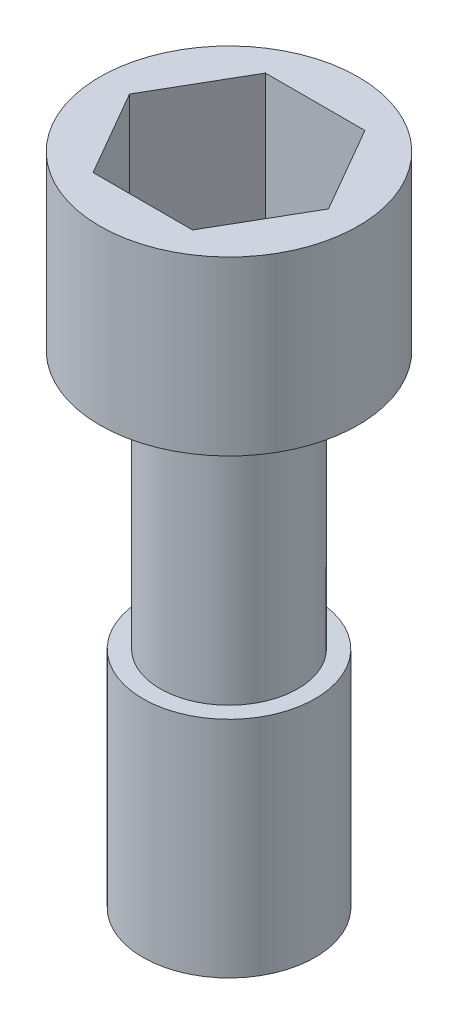
ISO-10303-21;
HEADER;
FILE_DESCRIPTION(('STEP AP214'),'2;1');
FILE_NAME('part.step','',(''),(''),'','','');
FILE_SCHEMA(('AUTOMOTIVE_DESIGN { 1 0 10303 214 1 1 1 1 }'));
ENDSEC;
DATA;
#1=APPLICATION_CONTEXT('core data for automotive mechanical design processes');
#2=APPLICATION_PROTOCOL_DEFINITION('international standard','automotive_design',2000,#1);
#3=PRODUCT_CONTEXT('',#1,'mechanical');
#4=PRODUCT('Part','Part','',(#3));
#5=PRODUCT_RELATED_PRODUCT_CATEGORY('part','',(#4));
#6=PRODUCT_DEFINITION_FORMATION('','',#4);
#7=PRODUCT_DEFINITION_CONTEXT('part definition',#1,'design');
#8=PRODUCT_DEFINITION('design','',#6,#7);
#9=PRODUCT_DEFINITION_SHAPE('','',#8);
#10=(LENGTH_UNIT() NAMED_UNIT(*) SI_UNIT(.MILLI.,.METRE.));
#11=(NAMED_UNIT(*) PLANE_ANGLE_UNIT() SI_UNIT($,.RADIAN.));
#12=(NAMED_UNIT(*) SI_UNIT($,.STERADIAN.) SOLID_ANGLE_UNIT());
#13=UNCERTAINTY_MEASURE_WITH_UNIT(LENGTH_MEASURE(1.E-05),#10,'distance_accuracy_value','');
#14=(GEOMETRIC_REPRESENTATION_CONTEXT(3) GLOBAL_UNCERTAINTY_ASSIGNED_CONTEXT((#13)) GLOBAL_UNIT_ASSIGNED_CONTEXT((#10,
#11,#12)) REPRESENTATION_CONTEXT('',''));
#15=CARTESIAN_POINT('',(0.,0.,0.));
#16=DIRECTION('',(0.,0.,1.));
#17=DIRECTION('',(1.,0.,0.));
#18=AXIS2_PLACEMENT_3D('',#15,#16,#17);
#19=CARTESIAN_POINT('',(0.,8.,0.));
#20=DIRECTION('',(0.,1.,0.));
#21=DIRECTION('',(0.,0.,1.));
#22=AXIS2_PLACEMENT_3D('',#19,#20,#21);
#23=PLANE('',#22);
#24=CARTESIAN_POINT('',(0.,8.,0.));
#25=DIRECTION('',(0.,1.,0.));
#26=DIRECTION('',(0.,0.,1.));
#27=AXIS2_PLACEMENT_3D('',#24,#25,#26);
#28=CIRCLE('',#27,7.5);
#29=CARTESIAN_POINT('',(0.,8.,7.5));
#30=VERTEX_POINT('',#29);
#31=EDGE_CURVE('E12',#30,#30,#28,.T.);
#32=ORIENTED_EDGE('',*,*,#31,.T.);
#33=EDGE_LOOP('',(#32));
#34=FACE_BOUND('',#33,.T.);
#35=DIRECTION('',(-0.5,0.,-0.866025403784439));
#36=VECTOR('',#35,1.);
#37=CARTESIAN_POINT('',(5.77350269189626,8.,0.));
#38=LINE('',#37,#36);
#39=CARTESIAN_POINT('',(5.77350269189626,8.,0.));
#40=VERTEX_POINT('',#39);
#41=CARTESIAN_POINT('',(2.88675134594813,8.,-5.));
#42=VERTEX_POINT('',#41);
#43=EDGE_CURVE('E136',#40,#42,#38,.T.);
#44=ORIENTED_EDGE('',*,*,#43,.F.);
#45=DIRECTION('',(0.5,0.,-0.866025403784439));
#46=VECTOR('',#45,1.);
#47=CARTESIAN_POINT('',(2.88675134594813,8.,5.));
#48=LINE('',#47,#46);
#49=CARTESIAN_POINT('',(2.88675134594813,8.,5.));
#50=VERTEX_POINT('',#49);
#51=EDGE_CURVE('E115',#50,#40,#48,.T.);
#52=ORIENTED_EDGE('',*,*,#51,.F.);
#53=DIRECTION('',(1.,0.,0.));
#54=VECTOR('',#53,1.);
#55=CARTESIAN_POINT('',(-2.88675134594813,8.,5.));
#56=LINE('',#55,#54);
#57=CARTESIAN_POINT('',(-2.88675134594813,8.,5.));
#58=VERTEX_POINT('',#57);
#59=EDGE_CURVE('E86',#58,#50,#56,.T.);
#60=ORIENTED_EDGE('',*,*,#59,.F.);
#61=DIRECTION('',(0.5,0.,0.866025403784439));
#62=VECTOR('',#61,1.);
#63=CARTESIAN_POINT('',(-5.77350269189626,8.,0.));
#64=LINE('',#63,#62);
#65=CARTESIAN_POINT('',(-5.77350269189626,8.,0.));
#66=VERTEX_POINT('',#65);
#67=EDGE_CURVE('E148',#66,#58,#64,.T.);
#68=ORIENTED_EDGE('',*,*,#67,.F.);
#69=DIRECTION('',(-0.5,0.,0.866025403784439));
#70=VECTOR('',#69,1.);
#71=CARTESIAN_POINT('',(-2.88675134594813,8.,-5.));
#72=LINE('',#71,#70);
#73=CARTESIAN_POINT('',(-2.88675134594813,8.,-5.));
#74=VERTEX_POINT('',#73);
#75=EDGE_CURVE('E135',#74,#66,#72,.T.);
#76=ORIENTED_EDGE('',*,*,#75,.F.);
#77=DIRECTION('',(-1.,0.,0.));
#78=VECTOR('',#77,1.);
#79=CARTESIAN_POINT('',(2.88675134594813,8.,-5.));
#80=LINE('',#79,#78);
#81=EDGE_CURVE('E124',#42,#74,#80,.T.);
#82=ORIENTED_EDGE('',*,*,#81,.F.);
#83=EDGE_LOOP('',(#44,#52,#60,#68,#76,#82));
#84=FACE_BOUND('',#83,.T.);
#85=ADVANCED_FACE('F63',(#34,#84),#23,.T.);
#86=CARTESIAN_POINT('',(0.,8.,0.));
#87=DIRECTION('',(0.,-1.,0.));
#88=DIRECTION('',(0.,0.,-1.));
#89=AXIS2_PLACEMENT_3D('',#86,#87,#88);
#90=CYLINDRICAL_SURFACE('',#89,7.5);
#91=ORIENTED_EDGE('',*,*,#31,.F.);
#92=EDGE_LOOP('',(#91));
#93=FACE_BOUND('',#92,.T.);
#94=CARTESIAN_POINT('',(0.,-2.,0.));
#95=DIRECTION('',(0.,-1.,0.));
#96=DIRECTION('',(0.,0.,-1.));
#97=AXIS2_PLACEMENT_3D('',#94,#95,#96);
#98=CIRCLE('',#97,7.5);
#99=CARTESIAN_POINT('',(0.,-2.,-7.5));
#100=VERTEX_POINT('',#99);
#101=EDGE_CURVE('E163',#100,#100,#98,.T.);
#102=ORIENTED_EDGE('',*,*,#101,.F.);
#103=EDGE_LOOP('',(#102));
#104=FACE_BOUND('',#103,.T.);
#105=ADVANCED_FACE('F65',(#93,#104),#90,.T.);
#106=CARTESIAN_POINT('',(2.88675134594813,8.,5.));
#107=DIRECTION('',(-0.866025403784439,0.,-0.5));
#108=DIRECTION('',(-0.5,0.,0.866025403784439));
#109=AXIS2_PLACEMENT_3D('',#106,#107,#108);
#110=PLANE('',#109);
#111=DIRECTION('',(0.5,0.,-0.866025403784439));
#112=VECTOR('',#111,1.);
#113=CARTESIAN_POINT('',(2.88675134594813,0.,5.));
#114=LINE('',#113,#112);
#115=CARTESIAN_POINT('',(2.88675134594813,0.,5.));
#116=VERTEX_POINT('',#115);
#117=CARTESIAN_POINT('',(5.77350269189626,0.,0.));
#118=VERTEX_POINT('',#117);
#119=EDGE_CURVE('E158',#116,#118,#114,.T.);
#120=ORIENTED_EDGE('',*,*,#119,.F.);
#121=DIRECTION('',(0.,-1.,0.));
#122=VECTOR('',#121,1.);
#123=CARTESIAN_POINT('',(2.88675134594813,8.,5.));
#124=LINE('',#123,#122);
#125=EDGE_CURVE('E157',#50,#116,#124,.T.);
#126=ORIENTED_EDGE('',*,*,#125,.F.);
#127=ORIENTED_EDGE('',*,*,#51,.T.);
#128=DIRECTION('',(0.,-1.,0.));
#129=VECTOR('',#128,1.);
#130=CARTESIAN_POINT('',(5.77350269189626,8.,0.));
#131=LINE('',#130,#129);
#132=EDGE_CURVE('E73',#40,#118,#131,.T.);
#133=ORIENTED_EDGE('',*,*,#132,.T.);
#134=EDGE_LOOP('',(#120,#126,#127,#133));
#135=FACE_BOUND('',#134,.T.);
#136=ADVANCED_FACE('F190',(#135),#110,.T.);
#137=CARTESIAN_POINT('',(5.77350269189626,8.,0.));
#138=DIRECTION('',(-0.866025403784439,0.,0.5));
#139=DIRECTION('',(0.5,0.,0.866025403784439));
#140=AXIS2_PLACEMENT_3D('',#137,#138,#139);
#141=PLANE('',#140);
#142=DIRECTION('',(-0.5,0.,-0.866025403784439));
#143=VECTOR('',#142,1.);
#144=CARTESIAN_POINT('',(5.77350269189626,0.,0.));
#145=LINE('',#144,#143);
#146=CARTESIAN_POINT('',(2.88675134594813,0.,-5.));
#147=VERTEX_POINT('',#146);
#148=EDGE_CURVE('E162',#118,#147,#145,.T.);
#149=ORIENTED_EDGE('',*,*,#148,.F.);
#150=ORIENTED_EDGE('',*,*,#132,.F.);
#151=ORIENTED_EDGE('',*,*,#43,.T.);
#152=DIRECTION('',(0.,-1.,0.));
#153=VECTOR('',#152,1.);
#154=CARTESIAN_POINT('',(2.88675134594813,8.,-5.));
#155=LINE('',#154,#153);
#156=EDGE_CURVE('E130',#42,#147,#155,.T.);
#157=ORIENTED_EDGE('',*,*,#156,.T.);
#158=EDGE_LOOP('',(#149,#150,#151,#157));
#159=FACE_BOUND('',#158,.T.);
#160=ADVANCED_FACE('F241',(#159),#141,.T.);
#161=CARTESIAN_POINT('',(2.88675134594813,8.,-5.));
#162=DIRECTION('',(0.,0.,1.));
#163=DIRECTION('',(1.,0.,0.));
#164=AXIS2_PLACEMENT_3D('',#161,#162,#163);
#165=PLANE('',#164);
#166=DIRECTION('',(-1.,0.,0.));
#167=VECTOR('',#166,1.);
#168=CARTESIAN_POINT('',(2.88675134594813,0.,-5.));
#169=LINE('',#168,#167);
#170=CARTESIAN_POINT('',(-2.88675134594813,0.,-5.));
#171=VERTEX_POINT('',#170);
#172=EDGE_CURVE('E167',#147,#171,#169,.T.);
#173=ORIENTED_EDGE('',*,*,#172,.F.);
#174=ORIENTED_EDGE('',*,*,#156,.F.);
#175=ORIENTED_EDGE('',*,*,#81,.T.);
#176=DIRECTION('',(0.,-1.,0.));
#177=VECTOR('',#176,1.);
#178=CARTESIAN_POINT('',(-2.88675134594813,8.,-5.));
#179=LINE('',#178,#177);
#180=EDGE_CURVE('E128',#74,#171,#179,.T.);
#181=ORIENTED_EDGE('',*,*,#180,.T.);
#182=EDGE_LOOP('',(#173,#174,#175,#181));
#183=FACE_BOUND('',#182,.T.);
#184=ADVANCED_FACE('F127',(#183),#165,.T.);
#185=CARTESIAN_POINT('',(-2.88675134594813,8.,-5.));
#186=DIRECTION('',(0.866025403784439,0.,0.5));
#187=DIRECTION('',(0.5,0.,-0.866025403784439));
#188=AXIS2_PLACEMENT_3D('',#185,#186,#187);
#189=PLANE('',#188);
#190=DIRECTION('',(-0.5,0.,0.866025403784439));
#191=VECTOR('',#190,1.);
#192=CARTESIAN_POINT('',(-2.88675134594813,0.,-5.));
#193=LINE('',#192,#191);
#194=CARTESIAN_POINT('',(-5.77350269189626,0.,0.));
#195=VERTEX_POINT('',#194);
#196=EDGE_CURVE('E142',#171,#195,#193,.T.);
#197=ORIENTED_EDGE('',*,*,#196,.F.);
#198=ORIENTED_EDGE('',*,*,#180,.F.);
#199=ORIENTED_EDGE('',*,*,#75,.T.);
#200=DIRECTION('',(0.,-1.,0.));
#201=VECTOR('',#200,1.);
#202=CARTESIAN_POINT('',(-5.77350269189626,8.,0.));
#203=LINE('',#202,#201);
#204=EDGE_CURVE('E145',#66,#195,#203,.T.);
#205=ORIENTED_EDGE('',*,*,#204,.T.);
#206=EDGE_LOOP('',(#197,#198,#199,#205));
#207=FACE_BOUND('',#206,.T.);
#208=ADVANCED_FACE('F139',(#207),#189,.T.);
#209=CARTESIAN_POINT('',(-5.77350269189626,8.,0.));
#210=DIRECTION('',(0.866025403784439,0.,-0.5));
#211=DIRECTION('',(-0.5,0.,-0.866025403784439));
#212=AXIS2_PLACEMENT_3D('',#209,#210,#211);
#213=PLANE('',#212);
#214=DIRECTION('',(0.5,0.,0.866025403784439));
#215=VECTOR('',#214,1.);
#216=CARTESIAN_POINT('',(-5.77350269189626,0.,0.));
#217=LINE('',#216,#215);
#218=CARTESIAN_POINT('',(-2.88675134594813,0.,5.));
#219=VERTEX_POINT('',#218);
#220=EDGE_CURVE('E172',#195,#219,#217,.T.);
#221=ORIENTED_EDGE('',*,*,#220,.F.);
#222=ORIENTED_EDGE('',*,*,#204,.F.);
#223=ORIENTED_EDGE('',*,*,#67,.T.);
#224=DIRECTION('',(0.,-1.,0.));
#225=VECTOR('',#224,1.);
#226=CARTESIAN_POINT('',(-2.88675134594813,8.,5.));
#227=LINE('',#226,#225);
#228=EDGE_CURVE('E80',#58,#219,#227,.T.);
#229=ORIENTED_EDGE('',*,*,#228,.T.);
#230=EDGE_LOOP('',(#221,#222,#223,#229));
#231=FACE_BOUND('',#230,.T.);
#232=ADVANCED_FACE('F248',(#231),#213,.T.);
#233=CARTESIAN_POINT('',(-2.88675134594813,8.,5.));
#234=DIRECTION('',(0.,0.,-1.));
#235=DIRECTION('',(-1.,0.,0.));
#236=AXIS2_PLACEMENT_3D('',#233,#234,#235);
#237=PLANE('',#236);
#238=DIRECTION('',(1.,0.,0.));
#239=VECTOR('',#238,1.);
#240=CARTESIAN_POINT('',(-2.88675134594813,0.,5.));
#241=LINE('',#240,#239);
#242=EDGE_CURVE('E176',#219,#116,#241,.T.);
#243=ORIENTED_EDGE('',*,*,#242,.F.);
#244=ORIENTED_EDGE('',*,*,#228,.F.);
#245=ORIENTED_EDGE('',*,*,#59,.T.);
#246=ORIENTED_EDGE('',*,*,#125,.T.);
#247=EDGE_LOOP('',(#243,#244,#245,#246));
#248=FACE_BOUND('',#247,.T.);
#249=ADVANCED_FACE('F194',(#248),#237,.T.);
#250=CARTESIAN_POINT('',(0.,0.,0.));
#251=DIRECTION('',(0.,-1.,0.));
#252=DIRECTION('',(0.,0.,-1.));
#253=AXIS2_PLACEMENT_3D('',#250,#251,#252);
#254=PLANE('',#253);
#255=ORIENTED_EDGE('',*,*,#242,.T.);
#256=ORIENTED_EDGE('',*,*,#119,.T.);
#257=ORIENTED_EDGE('',*,*,#148,.T.);
#258=ORIENTED_EDGE('',*,*,#172,.T.);
#259=ORIENTED_EDGE('',*,*,#196,.T.);
#260=ORIENTED_EDGE('',*,*,#220,.T.);
#261=EDGE_LOOP('',(#255,#256,#257,#258,#259,#260));
#262=FACE_BOUND('',#261,.T.);
#263=ADVANCED_FACE('F193',(#262),#254,.F.);
#264=CARTESIAN_POINT('',(0.,-2.,0.));
#265=DIRECTION('',(0.,-1.,0.));
#266=DIRECTION('',(0.,0.,-1.));
#267=AXIS2_PLACEMENT_3D('',#264,#265,#266);
#268=PLANE('',#267);
#269=CARTESIAN_POINT('',(0.,-2.,0.));
#270=DIRECTION('',(0.,-1.,0.));
#271=DIRECTION('',(0.,0.,-1.));
#272=AXIS2_PLACEMENT_3D('',#269,#270,#271);
#273=CIRCLE('',#272,4.);
#274=CARTESIAN_POINT('',(0.,-2.,-4.));
#275=VERTEX_POINT('',#274);
#276=EDGE_CURVE('E67',#275,#275,#273,.F.);
#277=ORIENTED_EDGE('',*,*,#276,.T.);
#278=EDGE_LOOP('',(#277));
#279=FACE_BOUND('',#278,.T.);
#280=ORIENTED_EDGE('',*,*,#101,.T.);
#281=EDGE_LOOP('',(#280));
#282=FACE_BOUND('',#281,.T.);
#283=ADVANCED_FACE('F255',(#279,#282),#268,.T.);
#284=CARTESIAN_POINT('',(0.,-17.,0.));
#285=DIRECTION('',(0.,1.,0.));
#286=DIRECTION('',(0.,0.,1.));
#287=AXIS2_PLACEMENT_3D('',#284,#285,#286);
#288=CYLINDRICAL_SURFACE('',#287,4.);
#289=ORIENTED_EDGE('',*,*,#276,.F.);
#290=EDGE_LOOP('',(#289));
#291=FACE_BOUND('',#290,.T.);
#292=CARTESIAN_POINT('',(0.,-17.,0.));
#293=DIRECTION('',(0.,-1.,0.));
#294=DIRECTION('',(0.,0.,-1.));
#295=AXIS2_PLACEMENT_3D('',#292,#293,#294);
#296=CIRCLE('',#295,4.);
#297=CARTESIAN_POINT('',(0.,-17.,-4.));
#298=VERTEX_POINT('',#297);
#299=EDGE_CURVE('E202',#298,#298,#296,.T.);
#300=ORIENTED_EDGE('',*,*,#299,.F.);
#301=EDGE_LOOP('',(#300));
#302=FACE_BOUND('',#301,.T.);
#303=ADVANCED_FACE('F220',(#291,#302),#288,.T.);
#304=CARTESIAN_POINT('',(0.,-30.,0.));
#305=DIRECTION('',(0.,1.,0.));
#306=DIRECTION('',(0.,0.,1.));
#307=AXIS2_PLACEMENT_3D('',#304,#305,#306);
#308=CYLINDRICAL_SURFACE('',#307,5.);
#309=CARTESIAN_POINT('',(0.,-30.,0.));
#310=DIRECTION('',(0.,-1.,0.));
#311=DIRECTION('',(0.,0.,-1.));
#312=AXIS2_PLACEMENT_3D('',#309,#310,#311);
#313=CIRCLE('',#312,5.);
#314=CARTESIAN_POINT('',(0.,-30.,-5.));
#315=VERTEX_POINT('',#314);
#316=EDGE_CURVE('E206',#315,#315,#313,.T.);
#317=ORIENTED_EDGE('',*,*,#316,.F.);
#318=EDGE_LOOP('',(#317));
#319=FACE_BOUND('',#318,.T.);
#320=CARTESIAN_POINT('',(0.,-17.,0.));
#321=DIRECTION('',(0.,-1.,0.));
#322=DIRECTION('',(0.,0.,-1.));
#323=AXIS2_PLACEMENT_3D('',#320,#321,#322);
#324=CIRCLE('',#323,5.);
#325=CARTESIAN_POINT('',(0.,-17.,-5.));
#326=VERTEX_POINT('',#325);
#327=EDGE_CURVE('E207',#326,#326,#324,.T.);
#328=ORIENTED_EDGE('',*,*,#327,.T.);
#329=EDGE_LOOP('',(#328));
#330=FACE_BOUND('',#329,.T.);
#331=ADVANCED_FACE('F217',(#319,#330),#308,.T.);
#332=CARTESIAN_POINT('',(0.,-30.,0.));
#333=DIRECTION('',(0.,-1.,0.));
#334=DIRECTION('',(0.,0.,-1.));
#335=AXIS2_PLACEMENT_3D('',#332,#333,#334);
#336=PLANE('',#335);
#337=ORIENTED_EDGE('',*,*,#316,.T.);
#338=EDGE_LOOP('',(#337));
#339=FACE_BOUND('',#338,.T.);
#340=ADVANCED_FACE('F215',(#339),#336,.T.);
#341=CARTESIAN_POINT('',(0.,-17.,0.));
#342=DIRECTION('',(0.,-1.,0.));
#343=DIRECTION('',(0.,0.,-1.));
#344=AXIS2_PLACEMENT_3D('',#341,#342,#343);
#345=PLANE('',#344);
#346=ORIENTED_EDGE('',*,*,#299,.T.);
#347=EDGE_LOOP('',(#346));
#348=FACE_BOUND('',#347,.T.);
#349=ORIENTED_EDGE('',*,*,#327,.F.);
#350=EDGE_LOOP('',(#349));
#351=FACE_BOUND('',#350,.T.);
#352=ADVANCED_FACE('F224',(#348,#351),#345,.F.);
#353=CLOSED_SHELL('',(#85,#105,#136,#160,#184,#208,#232,#249,#263,#283,#303,#331,#340,#352));
#354=MANIFOLD_SOLID_BREP('B2',#353);
#355=ADVANCED_BREP_SHAPE_REPRESENTATION('',(#18,#354),#14);
#356=SHAPE_DEFINITION_REPRESENTATION(#9,#355);
ENDSEC;
END-ISO-10303-21;
